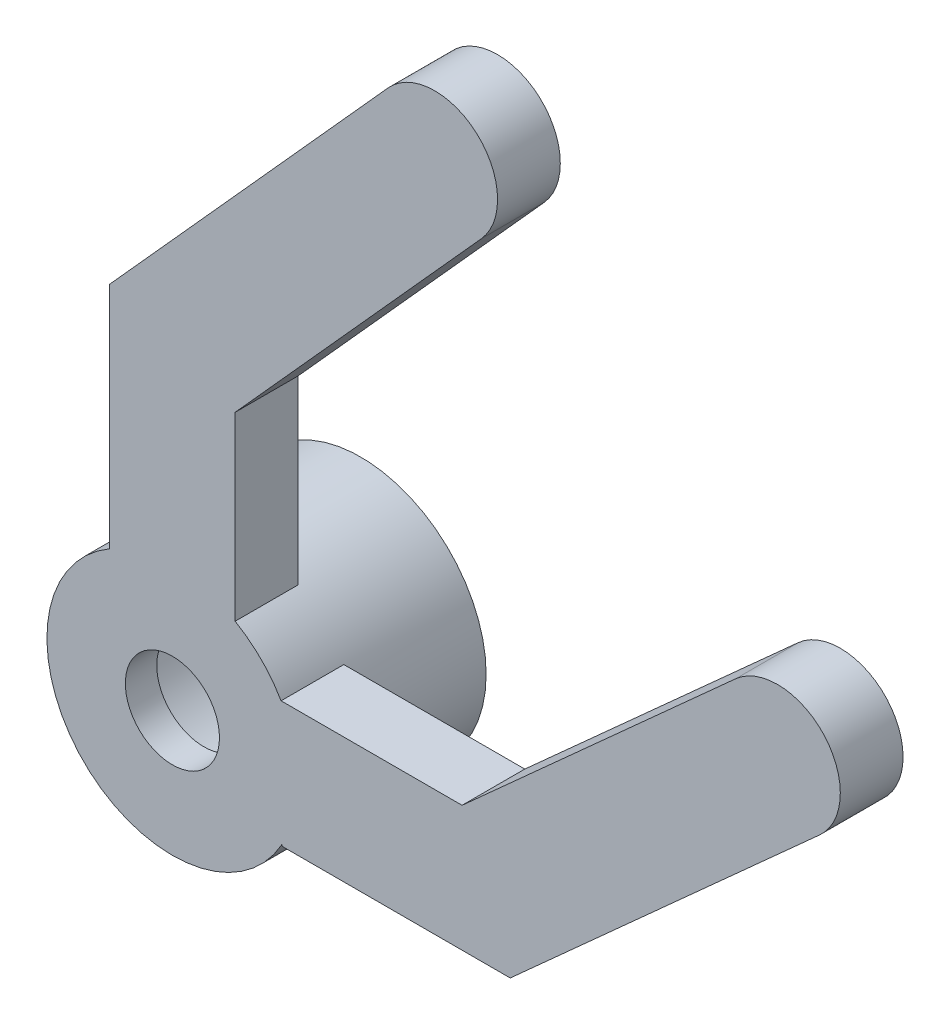
ISO-10303-21;
HEADER;
FILE_DESCRIPTION(('STEP AP214'),'2;1');
FILE_NAME('part.step','',(''),(''),'','','');
FILE_SCHEMA(('AUTOMOTIVE_DESIGN { 1 0 10303 214 1 1 1 1 }'));
ENDSEC;
DATA;
#1=APPLICATION_CONTEXT('core data for automotive mechanical design processes');
#2=APPLICATION_PROTOCOL_DEFINITION('international standard','automotive_design',2000,#1);
#3=PRODUCT_CONTEXT('',#1,'mechanical');
#4=PRODUCT('Part','Part','',(#3));
#5=PRODUCT_RELATED_PRODUCT_CATEGORY('part','',(#4));
#6=PRODUCT_DEFINITION_FORMATION('','',#4);
#7=PRODUCT_DEFINITION_CONTEXT('part definition',#1,'design');
#8=PRODUCT_DEFINITION('design','',#6,#7);
#9=PRODUCT_DEFINITION_SHAPE('','',#8);
#10=(LENGTH_UNIT() NAMED_UNIT(*) SI_UNIT(.MILLI.,.METRE.));
#11=(NAMED_UNIT(*) PLANE_ANGLE_UNIT() SI_UNIT($,.RADIAN.));
#12=(NAMED_UNIT(*) SI_UNIT($,.STERADIAN.) SOLID_ANGLE_UNIT());
#13=UNCERTAINTY_MEASURE_WITH_UNIT(LENGTH_MEASURE(1.E-05),#10,'distance_accuracy_value','');
#14=(GEOMETRIC_REPRESENTATION_CONTEXT(3) GLOBAL_UNCERTAINTY_ASSIGNED_CONTEXT((#13)) GLOBAL_UNIT_ASSIGNED_CONTEXT((#10,
#11,#12)) REPRESENTATION_CONTEXT('',''));
#15=CARTESIAN_POINT('',(0.,0.,0.));
#16=DIRECTION('',(0.,0.,1.));
#17=DIRECTION('',(1.,0.,0.));
#18=AXIS2_PLACEMENT_3D('',#15,#16,#17);
#19=CARTESIAN_POINT('',(0.,0.,6.));
#20=DIRECTION('',(0.,0.,-1.));
#21=DIRECTION('',(-1.,0.,0.));
#22=AXIS2_PLACEMENT_3D('',#19,#20,#21);
#23=CYLINDRICAL_SURFACE('',#22,3.);
#24=CARTESIAN_POINT('',(0.,0.,0.));
#25=DIRECTION('',(0.,0.,1.));
#26=DIRECTION('',(1.,0.,0.));
#27=AXIS2_PLACEMENT_3D('',#24,#25,#26);
#28=CIRCLE('',#27,3.);
#29=CARTESIAN_POINT('',(3.,0.,0.));
#30=VERTEX_POINT('',#29);
#31=EDGE_CURVE('E286',#30,#30,#28,.T.);
#32=ORIENTED_EDGE('',*,*,#31,.F.);
#33=EDGE_LOOP('',(#32));
#34=FACE_BOUND('',#33,.T.);
#35=CARTESIAN_POINT('',(0.,0.,5.));
#36=DIRECTION('',(0.,0.,1.));
#37=DIRECTION('',(1.,0.,0.));
#38=AXIS2_PLACEMENT_3D('',#35,#36,#37);
#39=CIRCLE('',#38,3.);
#40=CARTESIAN_POINT('',(3.,0.,5.));
#41=VERTEX_POINT('',#40);
#42=EDGE_CURVE('E281',#41,#41,#39,.T.);
#43=ORIENTED_EDGE('',*,*,#42,.T.);
#44=EDGE_LOOP('',(#43));
#45=FACE_BOUND('',#44,.T.);
#46=ADVANCED_FACE('F80',(#34,#45),#23,.F.);
#47=CARTESIAN_POINT('',(0.,0.,6.));
#48=DIRECTION('',(0.,0.,1.));
#49=DIRECTION('',(1.,0.,0.));
#50=AXIS2_PLACEMENT_3D('',#47,#48,#49);
#51=PLANE('',#50);
#52=CARTESIAN_POINT('',(0.,0.,6.));
#53=DIRECTION('',(0.,0.,1.));
#54=DIRECTION('',(1.,0.,0.));
#55=AXIS2_PLACEMENT_3D('',#52,#53,#54);
#56=CIRCLE('',#55,4.);
#57=CARTESIAN_POINT('',(3.46410161513775,2.,6.));
#58=VERTEX_POINT('',#57);
#59=CARTESIAN_POINT('',(2.,3.46410161513775,6.));
#60=VERTEX_POINT('',#59);
#61=EDGE_CURVE('E12',#58,#60,#56,.T.);
#62=ORIENTED_EDGE('',*,*,#61,.T.);
#63=DIRECTION('',(0.,1.,0.));
#64=VECTOR('',#63,1.);
#65=CARTESIAN_POINT('',(2.,0.,6.));
#66=LINE('',#65,#64);
#67=CARTESIAN_POINT('',(2.,9.23227192992917,6.));
#68=VERTEX_POINT('',#67);
#69=EDGE_CURVE('E200',#60,#68,#66,.T.);
#70=ORIENTED_EDGE('',*,*,#69,.T.);
#71=DIRECTION('',(0.66913060635886,0.743144825477393,0.));
#72=VECTOR('',#71,1.);
#73=CARTESIAN_POINT('',(-3.48631982588658,3.13909647094403,6.));
#74=LINE('',#73,#72);
#75=CARTESIAN_POINT('',(9.85042223044054,17.9510491057497,6.));
#76=VERTEX_POINT('',#75);
#77=EDGE_CURVE('E211',#68,#76,#74,.T.);
#78=ORIENTED_EDGE('',*,*,#77,.T.);
#79=CARTESIAN_POINT('',(8.36413257948575,19.2893103184674,6.));
#80=DIRECTION('',(0.,0.,1.));
#81=DIRECTION('',(1.,0.,0.));
#82=AXIS2_PLACEMENT_3D('',#79,#80,#81);
#83=CIRCLE('',#82,2.);
#84=CARTESIAN_POINT('',(6.87784292853096,20.6275715311851,6.));
#85=VERTEX_POINT('',#84);
#86=EDGE_CURVE('E180',#76,#85,#83,.T.);
#87=ORIENTED_EDGE('',*,*,#86,.T.);
#88=DIRECTION('',(0.66913060635886,0.743144825477393,0.));
#89=VECTOR('',#88,1.);
#90=CARTESIAN_POINT('',(-6.45889912779615,5.81561889637947,6.));
#91=LINE('',#90,#89);
#92=CARTESIAN_POINT('',(-2.,10.7677280700708,6.));
#93=VERTEX_POINT('',#92);
#94=EDGE_CURVE('E214',#93,#85,#91,.T.);
#95=ORIENTED_EDGE('',*,*,#94,.F.);
#96=DIRECTION('',(0.,1.,0.));
#97=VECTOR('',#96,1.);
#98=CARTESIAN_POINT('',(-2.,0.,6.));
#99=LINE('',#98,#97);
#100=CARTESIAN_POINT('',(-2.,3.46410161513775,6.));
#101=VERTEX_POINT('',#100);
#102=EDGE_CURVE('E96',#101,#93,#99,.T.);
#103=ORIENTED_EDGE('',*,*,#102,.F.);
#104=CARTESIAN_POINT('',(3.48876915309996,-1.95665270203431,6.));
#105=VERTEX_POINT('',#104);
#106=EDGE_CURVE('E89',#101,#105,#56,.T.);
#107=ORIENTED_EDGE('',*,*,#106,.T.);
#108=DIRECTION('',(0.352165204510549,-0.935937855165632,0.));
#109=VECTOR('',#108,1.);
#110=CARTESIAN_POINT('',(2.41116882981123,0.907250154883053,6.));
#111=LINE('',#110,#109);
#112=CARTESIAN_POINT('',(3.50507943478032,-2.,6.));
#113=VERTEX_POINT('',#112);
#114=EDGE_CURVE('E253',#105,#113,#111,.T.);
#115=ORIENTED_EDGE('',*,*,#114,.T.);
#116=DIRECTION('',(1.,0.,0.));
#117=VECTOR('',#116,1.);
#118=CARTESIAN_POINT('',(0.,-2.,6.));
#119=LINE('',#118,#117);
#120=CARTESIAN_POINT('',(10.7677280700708,-2.,6.));
#121=VERTEX_POINT('',#120);
#122=EDGE_CURVE('E256',#113,#121,#119,.T.);
#123=ORIENTED_EDGE('',*,*,#122,.T.);
#124=DIRECTION('',(0.743144825477392,0.66913060635886,0.));
#125=VECTOR('',#124,1.);
#126=CARTESIAN_POINT('',(5.81561889637948,-6.45889912779616,6.));
#127=LINE('',#126,#125);
#128=CARTESIAN_POINT('',(20.6275715311851,6.87784292853097,6.));
#129=VERTEX_POINT('',#128);
#130=EDGE_CURVE('E232',#121,#129,#127,.T.);
#131=ORIENTED_EDGE('',*,*,#130,.T.);
#132=CARTESIAN_POINT('',(19.2893103184674,8.36413257948575,6.));
#133=DIRECTION('',(0.,0.,1.));
#134=DIRECTION('',(1.,0.,0.));
#135=AXIS2_PLACEMENT_3D('',#132,#133,#134);
#136=CIRCLE('',#135,2.);
#137=CARTESIAN_POINT('',(17.9510491057497,9.85042223044054,6.));
#138=VERTEX_POINT('',#137);
#139=EDGE_CURVE('E219',#138,#129,#136,.F.);
#140=ORIENTED_EDGE('',*,*,#139,.F.);
#141=DIRECTION('',(0.743144825477393,0.66913060635886,0.));
#142=VECTOR('',#141,1.);
#143=CARTESIAN_POINT('',(3.13909647094404,-3.48631982588658,6.));
#144=LINE('',#143,#142);
#145=CARTESIAN_POINT('',(9.23227192992917,2.,6.));
#146=VERTEX_POINT('',#145);
#147=EDGE_CURVE('E250',#146,#138,#144,.T.);
#148=ORIENTED_EDGE('',*,*,#147,.F.);
#149=DIRECTION('',(1.,0.,0.));
#150=VECTOR('',#149,1.);
#151=CARTESIAN_POINT('',(0.,2.,6.));
#152=LINE('',#151,#150);
#153=EDGE_CURVE('E102',#58,#146,#152,.T.);
#154=ORIENTED_EDGE('',*,*,#153,.F.);
#155=EDGE_LOOP('',(#62,#70,#78,#87,#95,#103,#107,#115,#123,#131,#140,#148,#154));
#156=FACE_BOUND('',#155,.T.);
#157=CARTESIAN_POINT('',(0.,0.,6.));
#158=DIRECTION('',(0.,0.,1.));
#159=DIRECTION('',(1.,0.,0.));
#160=AXIS2_PLACEMENT_3D('',#157,#158,#159);
#161=CIRCLE('',#160,1.5);
#162=CARTESIAN_POINT('',(1.5,0.,6.));
#163=VERTEX_POINT('',#162);
#164=EDGE_CURVE('E263',#163,#163,#161,.T.);
#165=ORIENTED_EDGE('',*,*,#164,.F.);
#166=EDGE_LOOP('',(#165));
#167=FACE_BOUND('',#166,.T.);
#168=ADVANCED_FACE('F295',(#156,#167),#51,.T.);
#169=CARTESIAN_POINT('',(0.,0.,0.));
#170=DIRECTION('',(0.,0.,1.));
#171=DIRECTION('',(1.,0.,0.));
#172=AXIS2_PLACEMENT_3D('',#169,#170,#171);
#173=PLANE('',#172);
#174=CARTESIAN_POINT('',(0.,0.,0.));
#175=DIRECTION('',(0.,0.,1.));
#176=DIRECTION('',(1.,0.,0.));
#177=AXIS2_PLACEMENT_3D('',#174,#175,#176);
#178=CIRCLE('',#177,4.);
#179=CARTESIAN_POINT('',(4.,0.,0.));
#180=VERTEX_POINT('',#179);
#181=EDGE_CURVE('E84',#180,#180,#178,.T.);
#182=ORIENTED_EDGE('',*,*,#181,.F.);
#183=EDGE_LOOP('',(#182));
#184=FACE_BOUND('',#183,.T.);
#185=ORIENTED_EDGE('',*,*,#31,.T.);
#186=EDGE_LOOP('',(#185));
#187=FACE_BOUND('',#186,.T.);
#188=ADVANCED_FACE('F343',(#184,#187),#173,.F.);
#189=CARTESIAN_POINT('',(0.,0.,6.));
#190=DIRECTION('',(0.,0.,-1.));
#191=DIRECTION('',(-1.,0.,0.));
#192=AXIS2_PLACEMENT_3D('',#189,#190,#191);
#193=CYLINDRICAL_SURFACE('',#192,4.);
#194=CARTESIAN_POINT('',(0.,0.,4.));
#195=DIRECTION('',(0.,0.,1.));
#196=DIRECTION('',(1.,0.,0.));
#197=AXIS2_PLACEMENT_3D('',#194,#195,#196);
#198=CIRCLE('',#197,4.);
#199=CARTESIAN_POINT('',(2.,3.46410161513775,4.));
#200=VERTEX_POINT('',#199);
#201=CARTESIAN_POINT('',(-2.,3.46410161513775,4.));
#202=VERTEX_POINT('',#201);
#203=EDGE_CURVE('E208',#200,#202,#198,.T.);
#204=ORIENTED_EDGE('',*,*,#203,.F.);
#205=DIRECTION('',(0.,0.,1.));
#206=VECTOR('',#205,1.);
#207=CARTESIAN_POINT('',(2.,3.46410161513775,4.));
#208=LINE('',#207,#206);
#209=EDGE_CURVE('E220',#200,#60,#208,.T.);
#210=ORIENTED_EDGE('',*,*,#209,.T.);
#211=ORIENTED_EDGE('',*,*,#61,.F.);
#212=DIRECTION('',(0.,0.,1.));
#213=VECTOR('',#212,1.);
#214=CARTESIAN_POINT('',(3.46410161513775,2.,4.));
#215=LINE('',#214,#213);
#216=CARTESIAN_POINT('',(3.46410161513775,2.,4.));
#217=VERTEX_POINT('',#216);
#218=EDGE_CURVE('E271',#217,#58,#215,.T.);
#219=ORIENTED_EDGE('',*,*,#218,.F.);
#220=CARTESIAN_POINT('',(0.,0.,4.));
#221=DIRECTION('',(0.,0.,1.));
#222=DIRECTION('',(1.,0.,0.));
#223=AXIS2_PLACEMENT_3D('',#220,#221,#222);
#224=CIRCLE('',#223,4.);
#225=CARTESIAN_POINT('',(3.48876915309996,-1.95665270203431,4.));
#226=VERTEX_POINT('',#225);
#227=EDGE_CURVE('E236',#226,#217,#224,.T.);
#228=ORIENTED_EDGE('',*,*,#227,.F.);
#229=DIRECTION('',(0.,0.,1.));
#230=VECTOR('',#229,1.);
#231=CARTESIAN_POINT('',(3.48876915309996,-1.95665270203431,4.));
#232=LINE('',#231,#230);
#233=EDGE_CURVE('E268',#226,#105,#232,.T.);
#234=ORIENTED_EDGE('',*,*,#233,.T.);
#235=ORIENTED_EDGE('',*,*,#106,.F.);
#236=DIRECTION('',(0.,0.,1.));
#237=VECTOR('',#236,1.);
#238=CARTESIAN_POINT('',(-2.,3.46410161513775,4.));
#239=LINE('',#238,#237);
#240=EDGE_CURVE('E223',#202,#101,#239,.T.);
#241=ORIENTED_EDGE('',*,*,#240,.F.);
#242=EDGE_LOOP('',(#204,#210,#211,#219,#228,#234,#235,#241));
#243=FACE_BOUND('',#242,.T.);
#244=ORIENTED_EDGE('',*,*,#181,.T.);
#245=EDGE_LOOP('',(#244));
#246=FACE_BOUND('',#245,.T.);
#247=ADVANCED_FACE('F82',(#243,#246),#193,.T.);
#248=CARTESIAN_POINT('',(0.,0.,5.));
#249=DIRECTION('',(0.,0.,1.));
#250=DIRECTION('',(1.,0.,0.));
#251=AXIS2_PLACEMENT_3D('',#248,#249,#250);
#252=PLANE('',#251);
#253=CARTESIAN_POINT('',(0.,0.,5.));
#254=DIRECTION('',(0.,0.,1.));
#255=DIRECTION('',(1.,0.,0.));
#256=AXIS2_PLACEMENT_3D('',#253,#254,#255);
#257=CIRCLE('',#256,1.5);
#258=CARTESIAN_POINT('',(1.5,0.,5.));
#259=VERTEX_POINT('',#258);
#260=EDGE_CURVE('E278',#259,#259,#257,.T.);
#261=ORIENTED_EDGE('',*,*,#260,.T.);
#262=EDGE_LOOP('',(#261));
#263=FACE_BOUND('',#262,.T.);
#264=ORIENTED_EDGE('',*,*,#42,.F.);
#265=EDGE_LOOP('',(#264));
#266=FACE_BOUND('',#265,.T.);
#267=ADVANCED_FACE('F347',(#263,#266),#252,.F.);
#268=CARTESIAN_POINT('',(0.,0.,5.));
#269=DIRECTION('',(0.,0.,1.));
#270=DIRECTION('',(1.,0.,0.));
#271=AXIS2_PLACEMENT_3D('',#268,#269,#270);
#272=CYLINDRICAL_SURFACE('',#271,1.5);
#273=ORIENTED_EDGE('',*,*,#260,.F.);
#274=EDGE_LOOP('',(#273));
#275=FACE_BOUND('',#274,.T.);
#276=ORIENTED_EDGE('',*,*,#164,.T.);
#277=EDGE_LOOP('',(#276));
#278=FACE_BOUND('',#277,.T.);
#279=ADVANCED_FACE('F357',(#275,#278),#272,.F.);
#280=CARTESIAN_POINT('',(19.2893103184674,8.36413257948575,4.));
#281=DIRECTION('',(0.,0.,1.));
#282=DIRECTION('',(1.,0.,0.));
#283=AXIS2_PLACEMENT_3D('',#280,#281,#282);
#284=CYLINDRICAL_SURFACE('',#283,2.);
#285=ORIENTED_EDGE('',*,*,#139,.T.);
#286=DIRECTION('',(0.,0.,1.));
#287=VECTOR('',#286,1.);
#288=CARTESIAN_POINT('',(20.6275715311851,6.87784292853097,4.));
#289=LINE('',#288,#287);
#290=CARTESIAN_POINT('',(20.6275715311851,6.87784292853097,4.));
#291=VERTEX_POINT('',#290);
#292=EDGE_CURVE('E261',#291,#129,#289,.T.);
#293=ORIENTED_EDGE('',*,*,#292,.F.);
#294=CARTESIAN_POINT('',(19.2893103184674,8.36413257948575,4.));
#295=DIRECTION('',(0.,0.,1.));
#296=DIRECTION('',(1.,0.,0.));
#297=AXIS2_PLACEMENT_3D('',#294,#295,#296);
#298=CIRCLE('',#297,2.);
#299=CARTESIAN_POINT('',(17.9510491057497,9.85042223044054,4.));
#300=VERTEX_POINT('',#299);
#301=EDGE_CURVE('E229',#300,#291,#298,.F.);
#302=ORIENTED_EDGE('',*,*,#301,.F.);
#303=DIRECTION('',(0.,0.,1.));
#304=VECTOR('',#303,1.);
#305=CARTESIAN_POINT('',(17.9510491057497,9.85042223044054,4.));
#306=LINE('',#305,#304);
#307=EDGE_CURVE('E247',#300,#138,#306,.T.);
#308=ORIENTED_EDGE('',*,*,#307,.T.);
#309=EDGE_LOOP('',(#285,#293,#302,#308));
#310=FACE_BOUND('',#309,.T.);
#311=ADVANCED_FACE('F322',(#310),#284,.T.);
#312=CARTESIAN_POINT('',(5.81561889637948,-6.45889912779616,4.));
#313=DIRECTION('',(0.66913060635886,-0.743144825477392,0.));
#314=DIRECTION('',(0.743144825477392,0.66913060635886,0.));
#315=AXIS2_PLACEMENT_3D('',#312,#313,#314);
#316=PLANE('',#315);
#317=ORIENTED_EDGE('',*,*,#130,.F.);
#318=DIRECTION('',(0.,0.,1.));
#319=VECTOR('',#318,1.);
#320=CARTESIAN_POINT('',(10.7677280700708,-2.,4.));
#321=LINE('',#320,#319);
#322=CARTESIAN_POINT('',(10.7677280700708,-2.,4.));
#323=VERTEX_POINT('',#322);
#324=EDGE_CURVE('E264',#323,#121,#321,.T.);
#325=ORIENTED_EDGE('',*,*,#324,.F.);
#326=DIRECTION('',(0.743144825477392,0.66913060635886,0.));
#327=VECTOR('',#326,1.);
#328=CARTESIAN_POINT('',(5.81561889637948,-6.45889912779616,4.));
#329=LINE('',#328,#327);
#330=EDGE_CURVE('E244',#323,#291,#329,.T.);
#331=ORIENTED_EDGE('',*,*,#330,.T.);
#332=ORIENTED_EDGE('',*,*,#292,.T.);
#333=EDGE_LOOP('',(#317,#325,#331,#332));
#334=FACE_BOUND('',#333,.T.);
#335=ADVANCED_FACE('F326',(#334),#316,.T.);
#336=CARTESIAN_POINT('',(0.,-2.,4.));
#337=DIRECTION('',(0.,-1.,0.));
#338=DIRECTION('',(0.,0.,-1.));
#339=AXIS2_PLACEMENT_3D('',#336,#337,#338);
#340=PLANE('',#339);
#341=ORIENTED_EDGE('',*,*,#122,.F.);
#342=DIRECTION('',(0.,0.,1.));
#343=VECTOR('',#342,1.);
#344=CARTESIAN_POINT('',(3.50507943478032,-2.,4.));
#345=LINE('',#344,#343);
#346=CARTESIAN_POINT('',(3.50507943478032,-2.,4.));
#347=VERTEX_POINT('',#346);
#348=EDGE_CURVE('E266',#347,#113,#345,.T.);
#349=ORIENTED_EDGE('',*,*,#348,.F.);
#350=DIRECTION('',(1.,0.,0.));
#351=VECTOR('',#350,1.);
#352=CARTESIAN_POINT('',(0.,-2.,4.));
#353=LINE('',#352,#351);
#354=EDGE_CURVE('E241',#347,#323,#353,.T.);
#355=ORIENTED_EDGE('',*,*,#354,.T.);
#356=ORIENTED_EDGE('',*,*,#324,.T.);
#357=EDGE_LOOP('',(#341,#349,#355,#356));
#358=FACE_BOUND('',#357,.T.);
#359=ADVANCED_FACE('F328',(#358),#340,.T.);
#360=CARTESIAN_POINT('',(2.41116882981123,0.907250154883053,4.));
#361=DIRECTION('',(-0.935937855165632,-0.352165204510549,0.));
#362=DIRECTION('',(0.352165204510549,-0.935937855165632,0.));
#363=AXIS2_PLACEMENT_3D('',#360,#361,#362);
#364=PLANE('',#363);
#365=ORIENTED_EDGE('',*,*,#114,.F.);
#366=ORIENTED_EDGE('',*,*,#233,.F.);
#367=DIRECTION('',(0.352165204510549,-0.935937855165632,0.));
#368=VECTOR('',#367,1.);
#369=CARTESIAN_POINT('',(2.41116882981123,0.907250154883053,4.));
#370=LINE('',#369,#368);
#371=EDGE_CURVE('E238',#226,#347,#370,.T.);
#372=ORIENTED_EDGE('',*,*,#371,.T.);
#373=ORIENTED_EDGE('',*,*,#348,.T.);
#374=EDGE_LOOP('',(#365,#366,#372,#373));
#375=FACE_BOUND('',#374,.T.);
#376=ADVANCED_FACE('F300',(#375),#364,.T.);
#377=CARTESIAN_POINT('',(0.,2.,4.));
#378=DIRECTION('',(0.,-1.,0.));
#379=DIRECTION('',(0.,0.,-1.));
#380=AXIS2_PLACEMENT_3D('',#377,#378,#379);
#381=PLANE('',#380);
#382=ORIENTED_EDGE('',*,*,#153,.T.);
#383=DIRECTION('',(0.,0.,1.));
#384=VECTOR('',#383,1.);
#385=CARTESIAN_POINT('',(9.23227192992917,2.,4.));
#386=LINE('',#385,#384);
#387=CARTESIAN_POINT('',(9.23227192992917,2.,4.));
#388=VERTEX_POINT('',#387);
#389=EDGE_CURVE('E273',#388,#146,#386,.T.);
#390=ORIENTED_EDGE('',*,*,#389,.F.);
#391=DIRECTION('',(1.,0.,0.));
#392=VECTOR('',#391,1.);
#393=CARTESIAN_POINT('',(0.,2.,4.));
#394=LINE('',#393,#392);
#395=EDGE_CURVE('E234',#217,#388,#394,.T.);
#396=ORIENTED_EDGE('',*,*,#395,.F.);
#397=ORIENTED_EDGE('',*,*,#218,.T.);
#398=EDGE_LOOP('',(#382,#390,#396,#397));
#399=FACE_BOUND('',#398,.T.);
#400=ADVANCED_FACE('F313',(#399),#381,.F.);
#401=CARTESIAN_POINT('',(3.13909647094404,-3.48631982588658,4.));
#402=DIRECTION('',(0.66913060635886,-0.743144825477393,0.));
#403=DIRECTION('',(0.743144825477393,0.66913060635886,0.));
#404=AXIS2_PLACEMENT_3D('',#401,#402,#403);
#405=PLANE('',#404);
#406=ORIENTED_EDGE('',*,*,#147,.T.);
#407=ORIENTED_EDGE('',*,*,#307,.F.);
#408=DIRECTION('',(0.743144825477393,0.66913060635886,0.));
#409=VECTOR('',#408,1.);
#410=CARTESIAN_POINT('',(3.13909647094404,-3.48631982588658,4.));
#411=LINE('',#410,#409);
#412=EDGE_CURVE('E231',#388,#300,#411,.T.);
#413=ORIENTED_EDGE('',*,*,#412,.F.);
#414=ORIENTED_EDGE('',*,*,#389,.T.);
#415=EDGE_LOOP('',(#406,#407,#413,#414));
#416=FACE_BOUND('',#415,.T.);
#417=ADVANCED_FACE('F317',(#416),#405,.F.);
#418=CARTESIAN_POINT('',(0.,0.,4.));
#419=DIRECTION('',(0.,0.,1.));
#420=DIRECTION('',(1.,0.,0.));
#421=AXIS2_PLACEMENT_3D('',#418,#419,#420);
#422=PLANE('',#421);
#423=ORIENTED_EDGE('',*,*,#301,.T.);
#424=ORIENTED_EDGE('',*,*,#330,.F.);
#425=ORIENTED_EDGE('',*,*,#354,.F.);
#426=ORIENTED_EDGE('',*,*,#371,.F.);
#427=ORIENTED_EDGE('',*,*,#227,.T.);
#428=ORIENTED_EDGE('',*,*,#395,.T.);
#429=ORIENTED_EDGE('',*,*,#412,.T.);
#430=EDGE_LOOP('',(#423,#424,#425,#426,#427,#428,#429));
#431=FACE_BOUND('',#430,.T.);
#432=ADVANCED_FACE('F309',(#431),#422,.F.);
#433=CARTESIAN_POINT('',(-3.48631982588658,3.13909647094403,4.));
#434=DIRECTION('',(0.743144825477393,-0.66913060635886,0.));
#435=DIRECTION('',(0.66913060635886,0.743144825477393,0.));
#436=AXIS2_PLACEMENT_3D('',#433,#434,#435);
#437=PLANE('',#436);
#438=ORIENTED_EDGE('',*,*,#77,.F.);
#439=DIRECTION('',(0.,0.,1.));
#440=VECTOR('',#439,1.);
#441=CARTESIAN_POINT('',(2.,9.23227192992917,4.));
#442=LINE('',#441,#440);
#443=CARTESIAN_POINT('',(2.,9.23227192992917,4.));
#444=VERTEX_POINT('',#443);
#445=EDGE_CURVE('E199',#444,#68,#442,.T.);
#446=ORIENTED_EDGE('',*,*,#445,.F.);
#447=DIRECTION('',(0.66913060635886,0.743144825477393,0.));
#448=VECTOR('',#447,1.);
#449=CARTESIAN_POINT('',(-3.48631982588658,3.13909647094403,4.));
#450=LINE('',#449,#448);
#451=CARTESIAN_POINT('',(9.85042223044054,17.9510491057497,4.));
#452=VERTEX_POINT('',#451);
#453=EDGE_CURVE('E192',#444,#452,#450,.T.);
#454=ORIENTED_EDGE('',*,*,#453,.T.);
#455=DIRECTION('',(0.,0.,1.));
#456=VECTOR('',#455,1.);
#457=CARTESIAN_POINT('',(9.85042223044054,17.9510491057497,4.));
#458=LINE('',#457,#456);
#459=EDGE_CURVE('E175',#452,#76,#458,.T.);
#460=ORIENTED_EDGE('',*,*,#459,.T.);
#461=EDGE_LOOP('',(#438,#446,#454,#460));
#462=FACE_BOUND('',#461,.T.);
#463=ADVANCED_FACE('F198',(#462),#437,.T.);
#464=CARTESIAN_POINT('',(2.,0.,4.));
#465=DIRECTION('',(1.,0.,0.));
#466=DIRECTION('',(0.,0.,-1.));
#467=AXIS2_PLACEMENT_3D('',#464,#465,#466);
#468=PLANE('',#467);
#469=ORIENTED_EDGE('',*,*,#69,.F.);
#470=ORIENTED_EDGE('',*,*,#209,.F.);
#471=DIRECTION('',(0.,1.,0.));
#472=VECTOR('',#471,1.);
#473=CARTESIAN_POINT('',(2.,0.,4.));
#474=LINE('',#473,#472);
#475=EDGE_CURVE('E186',#200,#444,#474,.T.);
#476=ORIENTED_EDGE('',*,*,#475,.T.);
#477=ORIENTED_EDGE('',*,*,#445,.T.);
#478=EDGE_LOOP('',(#469,#470,#476,#477));
#479=FACE_BOUND('',#478,.T.);
#480=ADVANCED_FACE('F396',(#479),#468,.T.);
#481=CARTESIAN_POINT('',(-2.,0.,4.));
#482=DIRECTION('',(1.,0.,0.));
#483=DIRECTION('',(0.,0.,-1.));
#484=AXIS2_PLACEMENT_3D('',#481,#482,#483);
#485=PLANE('',#484);
#486=ORIENTED_EDGE('',*,*,#102,.T.);
#487=DIRECTION('',(0.,0.,1.));
#488=VECTOR('',#487,1.);
#489=CARTESIAN_POINT('',(-2.,10.7677280700708,4.));
#490=LINE('',#489,#488);
#491=CARTESIAN_POINT('',(-2.,10.7677280700708,4.));
#492=VERTEX_POINT('',#491);
#493=EDGE_CURVE('E225',#492,#93,#490,.T.);
#494=ORIENTED_EDGE('',*,*,#493,.F.);
#495=DIRECTION('',(0.,1.,0.));
#496=VECTOR('',#495,1.);
#497=CARTESIAN_POINT('',(-2.,0.,4.));
#498=LINE('',#497,#496);
#499=EDGE_CURVE('E206',#202,#492,#498,.T.);
#500=ORIENTED_EDGE('',*,*,#499,.F.);
#501=ORIENTED_EDGE('',*,*,#240,.T.);
#502=EDGE_LOOP('',(#486,#494,#500,#501));
#503=FACE_BOUND('',#502,.T.);
#504=ADVANCED_FACE('F403',(#503),#485,.F.);
#505=CARTESIAN_POINT('',(-6.45889912779615,5.81561889637947,4.));
#506=DIRECTION('',(0.743144825477393,-0.66913060635886,0.));
#507=DIRECTION('',(0.66913060635886,0.743144825477393,0.));
#508=AXIS2_PLACEMENT_3D('',#505,#506,#507);
#509=PLANE('',#508);
#510=ORIENTED_EDGE('',*,*,#94,.T.);
#511=DIRECTION('',(0.,0.,1.));
#512=VECTOR('',#511,1.);
#513=CARTESIAN_POINT('',(6.87784292853096,20.6275715311851,4.));
#514=LINE('',#513,#512);
#515=CARTESIAN_POINT('',(6.87784292853096,20.6275715311851,4.));
#516=VERTEX_POINT('',#515);
#517=EDGE_CURVE('E185',#516,#85,#514,.T.);
#518=ORIENTED_EDGE('',*,*,#517,.F.);
#519=DIRECTION('',(0.66913060635886,0.743144825477393,0.));
#520=VECTOR('',#519,1.);
#521=CARTESIAN_POINT('',(-6.45889912779615,5.81561889637947,4.));
#522=LINE('',#521,#520);
#523=EDGE_CURVE('E195',#492,#516,#522,.T.);
#524=ORIENTED_EDGE('',*,*,#523,.F.);
#525=ORIENTED_EDGE('',*,*,#493,.T.);
#526=EDGE_LOOP('',(#510,#518,#524,#525));
#527=FACE_BOUND('',#526,.T.);
#528=ADVANCED_FACE('F411',(#527),#509,.F.);
#529=CARTESIAN_POINT('',(8.36413257948575,19.2893103184674,4.));
#530=DIRECTION('',(0.,0.,1.));
#531=DIRECTION('',(1.,0.,0.));
#532=AXIS2_PLACEMENT_3D('',#529,#530,#531);
#533=CYLINDRICAL_SURFACE('',#532,2.);
#534=ORIENTED_EDGE('',*,*,#86,.F.);
#535=ORIENTED_EDGE('',*,*,#459,.F.);
#536=CARTESIAN_POINT('',(8.36413257948575,19.2893103184674,4.));
#537=DIRECTION('',(0.,0.,1.));
#538=DIRECTION('',(1.,0.,0.));
#539=AXIS2_PLACEMENT_3D('',#536,#537,#538);
#540=CIRCLE('',#539,2.);
#541=EDGE_CURVE('E178',#452,#516,#540,.T.);
#542=ORIENTED_EDGE('',*,*,#541,.T.);
#543=ORIENTED_EDGE('',*,*,#517,.T.);
#544=EDGE_LOOP('',(#534,#535,#542,#543));
#545=FACE_BOUND('',#544,.T.);
#546=ADVANCED_FACE('F177',(#545),#533,.T.);
#547=CARTESIAN_POINT('',(0.,0.,4.));
#548=DIRECTION('',(0.,0.,1.));
#549=DIRECTION('',(1.,0.,0.));
#550=AXIS2_PLACEMENT_3D('',#547,#548,#549);
#551=PLANE('',#550);
#552=ORIENTED_EDGE('',*,*,#453,.F.);
#553=ORIENTED_EDGE('',*,*,#475,.F.);
#554=ORIENTED_EDGE('',*,*,#203,.T.);
#555=ORIENTED_EDGE('',*,*,#499,.T.);
#556=ORIENTED_EDGE('',*,*,#523,.T.);
#557=ORIENTED_EDGE('',*,*,#541,.F.);
#558=EDGE_LOOP('',(#552,#553,#554,#555,#556,#557));
#559=FACE_BOUND('',#558,.T.);
#560=ADVANCED_FACE('F190',(#559),#551,.F.);
#561=CLOSED_SHELL('',(#46,#168,#188,#247,#267,#279,#311,#335,#359,#376,#400,#417,#432,#463,#480,
#504,#528,#546,#560));
#562=MANIFOLD_SOLID_BREP('B2',#561);
#563=ADVANCED_BREP_SHAPE_REPRESENTATION('',(#18,#562),#14);
#564=SHAPE_DEFINITION_REPRESENTATION(#9,#563);
ENDSEC;
END-ISO-10303-21;
